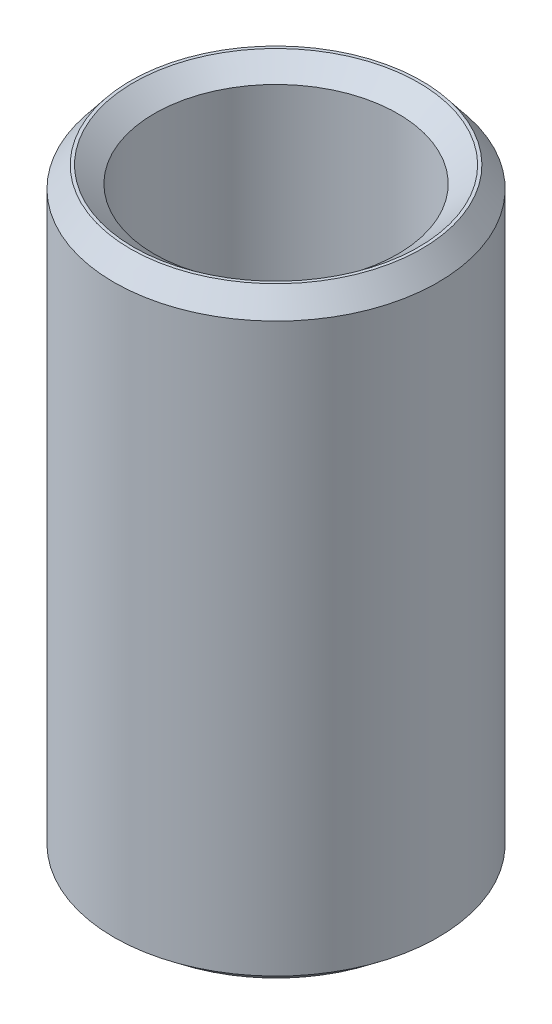
ISO-10303-21;
HEADER;
FILE_DESCRIPTION(('STEP AP214'),'2;1');
FILE_NAME('part.step','',(''),(''),'','','');
FILE_SCHEMA(('AUTOMOTIVE_DESIGN { 1 0 10303 214 1 1 1 1 }'));
ENDSEC;
DATA;
#1=APPLICATION_CONTEXT('core data for automotive mechanical design processes');
#2=APPLICATION_PROTOCOL_DEFINITION('international standard','automotive_design',2000,#1);
#3=PRODUCT_CONTEXT('',#1,'mechanical');
#4=PRODUCT('Part','Part','',(#3));
#5=PRODUCT_RELATED_PRODUCT_CATEGORY('part','',(#4));
#6=PRODUCT_DEFINITION_FORMATION('','',#4);
#7=PRODUCT_DEFINITION_CONTEXT('part definition',#1,'design');
#8=PRODUCT_DEFINITION('design','',#6,#7);
#9=PRODUCT_DEFINITION_SHAPE('','',#8);
#10=(LENGTH_UNIT() NAMED_UNIT(*) SI_UNIT(.MILLI.,.METRE.));
#11=(NAMED_UNIT(*) PLANE_ANGLE_UNIT() SI_UNIT($,.RADIAN.));
#12=(NAMED_UNIT(*) SI_UNIT($,.STERADIAN.) SOLID_ANGLE_UNIT());
#13=UNCERTAINTY_MEASURE_WITH_UNIT(LENGTH_MEASURE(1.E-05),#10,'distance_accuracy_value','');
#14=(GEOMETRIC_REPRESENTATION_CONTEXT(3) GLOBAL_UNCERTAINTY_ASSIGNED_CONTEXT((#13)) GLOBAL_UNIT_ASSIGNED_CONTEXT((#10,
#11,#12)) REPRESENTATION_CONTEXT('',''));
#15=CARTESIAN_POINT('',(0.,0.,0.));
#16=DIRECTION('',(0.,0.,1.));
#17=DIRECTION('',(1.,0.,0.));
#18=AXIS2_PLACEMENT_3D('',#15,#16,#17);
#19=CARTESIAN_POINT('',(0.,93.2746174315587,0.));
#20=DIRECTION('',(0.,-1.,0.));
#21=DIRECTION('',(0.,0.,-1.));
#22=AXIS2_PLACEMENT_3D('',#19,#20,#21);
#23=CYLINDRICAL_SURFACE('',#22,25.);
#24=CARTESIAN_POINT('',(0.,2.53575679207863,0.));
#25=DIRECTION('',(0.,1.,0.));
#26=DIRECTION('',(0.,0.,1.));
#27=AXIS2_PLACEMENT_3D('',#24,#25,#26);
#28=CIRCLE('',#27,25.);
#29=CARTESIAN_POINT('',(0.,2.53575679207863,25.));
#30=VERTEX_POINT('',#29);
#31=EDGE_CURVE('E10',#30,#30,#28,.T.);
#32=ORIENTED_EDGE('',*,*,#31,.T.);
#33=EDGE_LOOP('',(#32));
#34=FACE_BOUND('',#33,.T.);
#35=CARTESIAN_POINT('',(0.,90.0664669730382,0.));
#36=DIRECTION('',(0.,1.,0.));
#37=DIRECTION('',(0.,0.,1.));
#38=AXIS2_PLACEMENT_3D('',#35,#36,#37);
#39=CIRCLE('',#38,25.);
#40=CARTESIAN_POINT('',(0.,90.0664669730382,25.));
#41=VERTEX_POINT('',#40);
#42=EDGE_CURVE('E50',#41,#41,#39,.F.);
#43=ORIENTED_EDGE('',*,*,#42,.T.);
#44=EDGE_LOOP('',(#43));
#45=FACE_BOUND('',#44,.T.);
#46=ADVANCED_FACE('F39',(#34,#45),#23,.T.);
#47=CARTESIAN_POINT('',(0.,93.2746174315587,0.));
#48=DIRECTION('',(0.,1.,0.));
#49=DIRECTION('',(0.,0.,1.));
#50=AXIS2_PLACEMENT_3D('',#47,#48,#49);
#51=PLANE('',#50);
#52=CARTESIAN_POINT('',(0.,93.2746174315587,0.));
#53=DIRECTION('',(0.,1.,0.));
#54=DIRECTION('',(0.,0.,1.));
#55=AXIS2_PLACEMENT_3D('',#52,#53,#54);
#56=CIRCLE('',#55,21.9960968368792);
#57=CARTESIAN_POINT('',(0.,93.2746174315587,21.9960968368792));
#58=VERTEX_POINT('',#57);
#59=EDGE_CURVE('E58',#58,#58,#56,.F.);
#60=ORIENTED_EDGE('',*,*,#59,.T.);
#61=EDGE_LOOP('',(#60));
#62=FACE_BOUND('',#61,.T.);
#63=CARTESIAN_POINT('',(0.,93.2746174315587,0.));
#64=DIRECTION('',(0.,1.,0.));
#65=DIRECTION('',(0.,0.,1.));
#66=AXIS2_PLACEMENT_3D('',#63,#64,#65);
#67=CIRCLE('',#66,22.4642432079214);
#68=CARTESIAN_POINT('',(0.,93.2746174315587,22.4642432079214));
#69=VERTEX_POINT('',#68);
#70=EDGE_CURVE('E61',#69,#69,#67,.T.);
#71=ORIENTED_EDGE('',*,*,#70,.T.);
#72=EDGE_LOOP('',(#71));
#73=FACE_BOUND('',#72,.T.);
#74=ADVANCED_FACE('F88',(#62,#73),#51,.T.);
#75=CARTESIAN_POINT('',(0.,0.,0.));
#76=DIRECTION('',(0.,1.,0.));
#77=DIRECTION('',(0.,0.,1.));
#78=AXIS2_PLACEMENT_3D('',#75,#76,#77);
#79=PLANE('',#78);
#80=CARTESIAN_POINT('',(0.,0.,0.));
#81=DIRECTION('',(0.,1.,0.));
#82=DIRECTION('',(0.,0.,1.));
#83=AXIS2_PLACEMENT_3D('',#80,#81,#82);
#84=CIRCLE('',#83,21.3237031704374);
#85=CARTESIAN_POINT('',(0.,0.,21.3237031704374));
#86=VERTEX_POINT('',#85);
#87=EDGE_CURVE('E51',#86,#86,#84,.T.);
#88=ORIENTED_EDGE('',*,*,#87,.T.);
#89=EDGE_LOOP('',(#88));
#90=FACE_BOUND('',#89,.T.);
#91=CARTESIAN_POINT('',(0.,0.,0.));
#92=DIRECTION('',(0.,1.,0.));
#93=DIRECTION('',(0.,0.,1.));
#94=AXIS2_PLACEMENT_3D('',#91,#92,#93);
#95=CIRCLE('',#94,21.7918495414795);
#96=CARTESIAN_POINT('',(0.,0.,21.7918495414795));
#97=VERTEX_POINT('',#96);
#98=EDGE_CURVE('E54',#97,#97,#95,.F.);
#99=ORIENTED_EDGE('',*,*,#98,.T.);
#100=EDGE_LOOP('',(#99));
#101=FACE_BOUND('',#100,.T.);
#102=ADVANCED_FACE('F83',(#90,#101),#79,.F.);
#103=CARTESIAN_POINT('',(0.,93.2746174315587,0.));
#104=DIRECTION('',(0.,-1.,0.));
#105=DIRECTION('',(0.,0.,-1.));
#106=AXIS2_PLACEMENT_3D('',#103,#104,#105);
#107=CYLINDRICAL_SURFACE('',#106,18.7879463783588);
#108=CARTESIAN_POINT('',(0.,90.7388606394801,0.));
#109=DIRECTION('',(0.,1.,0.));
#110=DIRECTION('',(0.,0.,1.));
#111=AXIS2_PLACEMENT_3D('',#108,#109,#110);
#112=CIRCLE('',#111,18.7879463783588);
#113=CARTESIAN_POINT('',(0.,90.7388606394801,18.7879463783588));
#114=VERTEX_POINT('',#113);
#115=EDGE_CURVE('E67',#114,#114,#112,.T.);
#116=ORIENTED_EDGE('',*,*,#115,.T.);
#117=EDGE_LOOP('',(#116));
#118=FACE_BOUND('',#117,.T.);
#119=CARTESIAN_POINT('',(0.,3.20815045852049,0.));
#120=DIRECTION('',(0.,1.,0.));
#121=DIRECTION('',(0.,0.,1.));
#122=AXIS2_PLACEMENT_3D('',#119,#120,#121);
#123=CIRCLE('',#122,18.7879463783588);
#124=CARTESIAN_POINT('',(0.,3.20815045852049,18.7879463783588));
#125=VERTEX_POINT('',#124);
#126=EDGE_CURVE('E69',#125,#125,#123,.F.);
#127=ORIENTED_EDGE('',*,*,#126,.T.);
#128=EDGE_LOOP('',(#127));
#129=FACE_BOUND('',#128,.T.);
#130=ADVANCED_FACE('F71',(#118,#129),#107,.F.);
#131=CARTESIAN_POINT('',(0.,90.7388606394801,0.));
#132=DIRECTION('',(0.,1.,0.));
#133=DIRECTION('',(0.,0.,1.));
#134=AXIS2_PLACEMENT_3D('',#131,#132,#133);
#135=CONICAL_SURFACE('',#134,18.7879463783588,0.901929865164211);
#136=ORIENTED_EDGE('',*,*,#59,.F.);
#137=EDGE_LOOP('',(#136));
#138=FACE_BOUND('',#137,.T.);
#139=ORIENTED_EDGE('',*,*,#115,.F.);
#140=EDGE_LOOP('',(#139));
#141=FACE_BOUND('',#140,.T.);
#142=ADVANCED_FACE('F77',(#138,#141),#135,.F.);
#143=CARTESIAN_POINT('',(0.,0.,0.));
#144=DIRECTION('',(0.,-1.,0.));
#145=DIRECTION('',(0.,0.,-1.));
#146=AXIS2_PLACEMENT_3D('',#143,#144,#145);
#147=CONICAL_SURFACE('',#146,21.3237031704374,0.668866461630687);
#148=ORIENTED_EDGE('',*,*,#126,.F.);
#149=EDGE_LOOP('',(#148));
#150=FACE_BOUND('',#149,.T.);
#151=ORIENTED_EDGE('',*,*,#87,.F.);
#152=EDGE_LOOP('',(#151));
#153=FACE_BOUND('',#152,.T.);
#154=ADVANCED_FACE('F73',(#150,#153),#147,.F.);
#155=CARTESIAN_POINT('',(0.,2.53575679207863,0.));
#156=DIRECTION('',(0.,1.,0.));
#157=DIRECTION('',(0.,0.,1.));
#158=AXIS2_PLACEMENT_3D('',#155,#156,#157);
#159=CONICAL_SURFACE('',#158,25.,0.901929865164214);
#160=ORIENTED_EDGE('',*,*,#98,.F.);
#161=EDGE_LOOP('',(#160));
#162=FACE_BOUND('',#161,.T.);
#163=ORIENTED_EDGE('',*,*,#31,.F.);
#164=EDGE_LOOP('',(#163));
#165=FACE_BOUND('',#164,.T.);
#166=ADVANCED_FACE('F76',(#162,#165),#159,.T.);
#167=CARTESIAN_POINT('',(0.,93.2746174315587,0.));
#168=DIRECTION('',(0.,-1.,0.));
#169=DIRECTION('',(0.,0.,-1.));
#170=AXIS2_PLACEMENT_3D('',#167,#168,#169);
#171=CONICAL_SURFACE('',#170,22.4642432079214,0.668866461630684);
#172=ORIENTED_EDGE('',*,*,#42,.F.);
#173=EDGE_LOOP('',(#172));
#174=FACE_BOUND('',#173,.T.);
#175=ORIENTED_EDGE('',*,*,#70,.F.);
#176=EDGE_LOOP('',(#175));
#177=FACE_BOUND('',#176,.T.);
#178=ADVANCED_FACE('F45',(#174,#177),#171,.T.);
#179=CLOSED_SHELL('',(#46,#74,#102,#130,#142,#154,#166,#178));
#180=MANIFOLD_SOLID_BREP('B2',#179);
#181=ADVANCED_BREP_SHAPE_REPRESENTATION('',(#18,#180),#14);
#182=SHAPE_DEFINITION_REPRESENTATION(#9,#181);
ENDSEC;
END-ISO-10303-21;
